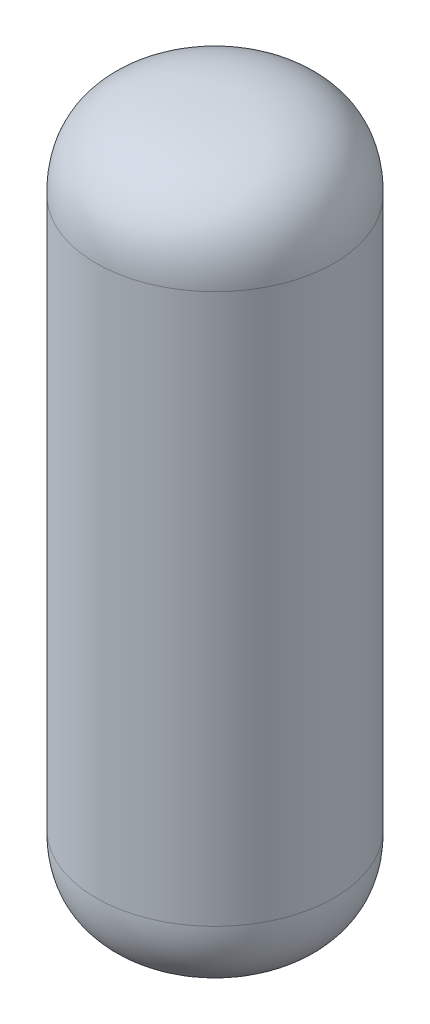
ISO-10303-21;
HEADER;
FILE_DESCRIPTION(('STEP AP214'),'2;1');
FILE_NAME('part.step','',(''),(''),'','','');
FILE_SCHEMA(('AUTOMOTIVE_DESIGN { 1 0 10303 214 1 1 1 1 }'));
ENDSEC;
DATA;
#1=APPLICATION_CONTEXT('core data for automotive mechanical design processes');
#2=APPLICATION_PROTOCOL_DEFINITION('international standard','automotive_design',2000,#1);
#3=PRODUCT_CONTEXT('',#1,'mechanical');
#4=PRODUCT('Part','Part','',(#3));
#5=PRODUCT_RELATED_PRODUCT_CATEGORY('part','',(#4));
#6=PRODUCT_DEFINITION_FORMATION('','',#4);
#7=PRODUCT_DEFINITION_CONTEXT('part definition',#1,'design');
#8=PRODUCT_DEFINITION('design','',#6,#7);
#9=PRODUCT_DEFINITION_SHAPE('','',#8);
#10=(LENGTH_UNIT() NAMED_UNIT(*) SI_UNIT(.MILLI.,.METRE.));
#11=(NAMED_UNIT(*) PLANE_ANGLE_UNIT() SI_UNIT($,.RADIAN.));
#12=(NAMED_UNIT(*) SI_UNIT($,.STERADIAN.) SOLID_ANGLE_UNIT());
#13=UNCERTAINTY_MEASURE_WITH_UNIT(LENGTH_MEASURE(1.E-05),#10,'distance_accuracy_value','');
#14=(GEOMETRIC_REPRESENTATION_CONTEXT(3) GLOBAL_UNCERTAINTY_ASSIGNED_CONTEXT((#13)) GLOBAL_UNIT_ASSIGNED_CONTEXT((#10,
#11,#12)) REPRESENTATION_CONTEXT('',''));
#15=CARTESIAN_POINT('',(0.,0.,0.));
#16=DIRECTION('',(0.,0.,1.));
#17=DIRECTION('',(1.,0.,0.));
#18=AXIS2_PLACEMENT_3D('',#15,#16,#17);
#19=CARTESIAN_POINT('',(-83.8,60.3810728615834,0.));
#20=CARTESIAN_POINT('',(-84.5787559812869,-1.3957305175766,0.));
#21=CARTESIAN_POINT('',(0.,0.,0.));
#22=B_SPLINE_CURVE_WITH_KNOTS('',2,(#19,#20,#21),.UNSPECIFIED.,.F.,.F.,(3,3),(0.,1.),.UNSPECIFIED.);
#23=CARTESIAN_POINT('',(0.,0.,0.));
#24=DIRECTION('',(0.,-1.,0.));
#25=AXIS1_PLACEMENT('',#23,#24);
#26=SURFACE_OF_REVOLUTION('',#22,#25);
#27=CARTESIAN_POINT('',(0.,0.,0.));
#28=VERTEX_POINT('',#27);
#29=VERTEX_LOOP('',#28);
#30=FACE_BOUND('',#29,.T.);
#31=CARTESIAN_POINT('',(0.,60.3810728615834,0.));
#32=DIRECTION('',(0.,-1.,0.));
#33=DIRECTION('',(0.,0.,-1.));
#34=AXIS2_PLACEMENT_3D('',#31,#32,#33);
#35=CIRCLE('',#34,83.8);
#36=CARTESIAN_POINT('',(0.,60.3810728615834,-83.8));
#37=VERTEX_POINT('',#36);
#38=EDGE_CURVE('E11',#37,#37,#35,.T.);
#39=ORIENTED_EDGE('',*,*,#38,.T.);
#40=EDGE_LOOP('',(#39));
#41=FACE_BOUND('',#40,.T.);
#42=ADVANCED_FACE('F36',(#30,#41),#26,.T.);
#43=CARTESIAN_POINT('',(0.,0.,0.));
#44=DIRECTION('',(0.,-1.,0.));
#45=DIRECTION('',(0.,0.,-1.));
#46=AXIS2_PLACEMENT_3D('',#43,#44,#45);
#47=CYLINDRICAL_SURFACE('',#46,83.8);
#48=ORIENTED_EDGE('',*,*,#38,.F.);
#49=EDGE_LOOP('',(#48));
#50=FACE_BOUND('',#49,.T.);
#51=CARTESIAN_POINT('',(0.,447.618927138417,0.));
#52=DIRECTION('',(0.,-1.,0.));
#53=DIRECTION('',(0.,0.,-1.));
#54=AXIS2_PLACEMENT_3D('',#51,#52,#53);
#55=CIRCLE('',#54,83.8);
#56=CARTESIAN_POINT('',(0.,447.618927138417,-83.8));
#57=VERTEX_POINT('',#56);
#58=EDGE_CURVE('E45',#57,#57,#55,.T.);
#59=ORIENTED_EDGE('',*,*,#58,.T.);
#60=EDGE_LOOP('',(#59));
#61=FACE_BOUND('',#60,.T.);
#62=ADVANCED_FACE('F60',(#50,#61),#47,.T.);
#63=CARTESIAN_POINT('',(0.,508.,0.));
#64=CARTESIAN_POINT('',(-84.5787559812867,509.395730517577,0.));
#65=CARTESIAN_POINT('',(-83.8,447.618927138417,0.));
#66=B_SPLINE_CURVE_WITH_KNOTS('',2,(#63,#64,#65),.UNSPECIFIED.,.F.,.F.,(3,3),(0.,1.),.UNSPECIFIED.);
#67=CARTESIAN_POINT('',(0.,0.,0.));
#68=DIRECTION('',(0.,-1.,0.));
#69=AXIS1_PLACEMENT('',#67,#68);
#70=SURFACE_OF_REVOLUTION('',#66,#69);
#71=ORIENTED_EDGE('',*,*,#58,.F.);
#72=EDGE_LOOP('',(#71));
#73=FACE_BOUND('',#72,.T.);
#74=CARTESIAN_POINT('',(0.,508.,0.));
#75=VERTEX_POINT('',#74);
#76=VERTEX_LOOP('',#75);
#77=FACE_BOUND('',#76,.T.);
#78=ADVANCED_FACE('F65',(#73,#77),#70,.T.);
#79=CLOSED_SHELL('',(#42,#62,#78));
#80=CARTESIAN_POINT('',(-78.5716278894658,423.012882539872,0.));
#81=CARTESIAN_POINT('',(-81.6090282805033,459.055502328142,0.));
#82=CARTESIAN_POINT('',(-76.6215476976147,501.289074506769,0.));
#83=CARTESIAN_POINT('',(0.,505.176662553165,0.));
#84=B_SPLINE_CURVE_WITH_KNOTS('',3,(#80,#81,#82,#83),.UNSPECIFIED.,.F.,.F.,(4,4),(0.,1.),.UNSPECIFIED.);
#85=CARTESIAN_POINT('',(0.,0.,0.));
#86=DIRECTION('',(0.,-1.,0.));
#87=AXIS1_PLACEMENT('',#85,#86);
#88=SURFACE_OF_REVOLUTION('',#84,#87);
#89=CARTESIAN_POINT('',(0.,505.176662553165,0.));
#90=VERTEX_POINT('',#89);
#91=VERTEX_LOOP('',#90);
#92=FACE_BOUND('',#91,.T.);
#93=CARTESIAN_POINT('',(0.,423.012882539872,0.));
#94=DIRECTION('',(0.,-1.,0.));
#95=DIRECTION('',(0.,0.,-1.));
#96=AXIS2_PLACEMENT_3D('',#93,#94,#95);
#97=CIRCLE('',#96,78.5716278894657);
#98=CARTESIAN_POINT('',(0.,423.012882539872,-78.5716278894657));
#99=VERTEX_POINT('',#98);
#100=EDGE_CURVE('E69',#99,#99,#97,.T.);
#101=ORIENTED_EDGE('',*,*,#100,.T.);
#102=EDGE_LOOP('',(#101));
#103=FACE_BOUND('',#102,.T.);
#104=ADVANCED_FACE('F90',(#92,#103),#88,.T.);
#105=CARTESIAN_POINT('',(0.,0.,0.));
#106=DIRECTION('',(0.,-1.,0.));
#107=DIRECTION('',(0.,0.,-1.));
#108=AXIS2_PLACEMENT_3D('',#105,#106,#107);
#109=CYLINDRICAL_SURFACE('',#108,78.5716278894658);
#110=ORIENTED_EDGE('',*,*,#100,.F.);
#111=EDGE_LOOP('',(#110));
#112=FACE_BOUND('',#111,.T.);
#113=CARTESIAN_POINT('',(0.,84.9871174601276,0.));
#114=DIRECTION('',(0.,-1.,0.));
#115=DIRECTION('',(0.,0.,-1.));
#116=AXIS2_PLACEMENT_3D('',#113,#114,#115);
#117=CIRCLE('',#116,78.5716278894658);
#118=CARTESIAN_POINT('',(0.,84.9871174601276,-78.5716278894658));
#119=VERTEX_POINT('',#118);
#120=EDGE_CURVE('E71',#119,#119,#117,.T.);
#121=ORIENTED_EDGE('',*,*,#120,.T.);
#122=EDGE_LOOP('',(#121));
#123=FACE_BOUND('',#122,.T.);
#124=ADVANCED_FACE('F93',(#112,#123),#109,.F.);
#125=CARTESIAN_POINT('',(0.,2.82333744683483,0.));
#126=CARTESIAN_POINT('',(-76.6215476976146,6.71092549323087,0.));
#127=CARTESIAN_POINT('',(-81.6090282805035,48.9444976718576,0.));
#128=CARTESIAN_POINT('',(-78.5716278894658,84.9871174601276,0.));
#129=B_SPLINE_CURVE_WITH_KNOTS('',3,(#125,#126,#127,#128),.UNSPECIFIED.,.F.,.F.,(4,4),(0.,1.),.UNSPECIFIED.);
#130=CARTESIAN_POINT('',(0.,0.,0.));
#131=DIRECTION('',(0.,-1.,0.));
#132=AXIS1_PLACEMENT('',#130,#131);
#133=SURFACE_OF_REVOLUTION('',#129,#132);
#134=ORIENTED_EDGE('',*,*,#120,.F.);
#135=EDGE_LOOP('',(#134));
#136=FACE_BOUND('',#135,.T.);
#137=CARTESIAN_POINT('',(0.,2.82333744683483,0.));
#138=VERTEX_POINT('',#137);
#139=VERTEX_LOOP('',#138);
#140=FACE_BOUND('',#139,.T.);
#141=ADVANCED_FACE('F97',(#136,#140),#133,.T.);
#142=CLOSED_SHELL('',(#104,#124,#141));
#143=ORIENTED_CLOSED_SHELL('',*,#142,.T.);
#144=BREP_WITH_VOIDS('B2',#79,(#143));
#145=ADVANCED_BREP_SHAPE_REPRESENTATION('',(#18,#144),#14);
#146=SHAPE_DEFINITION_REPRESENTATION(#9,#145);
ENDSEC;
END-ISO-10303-21;
